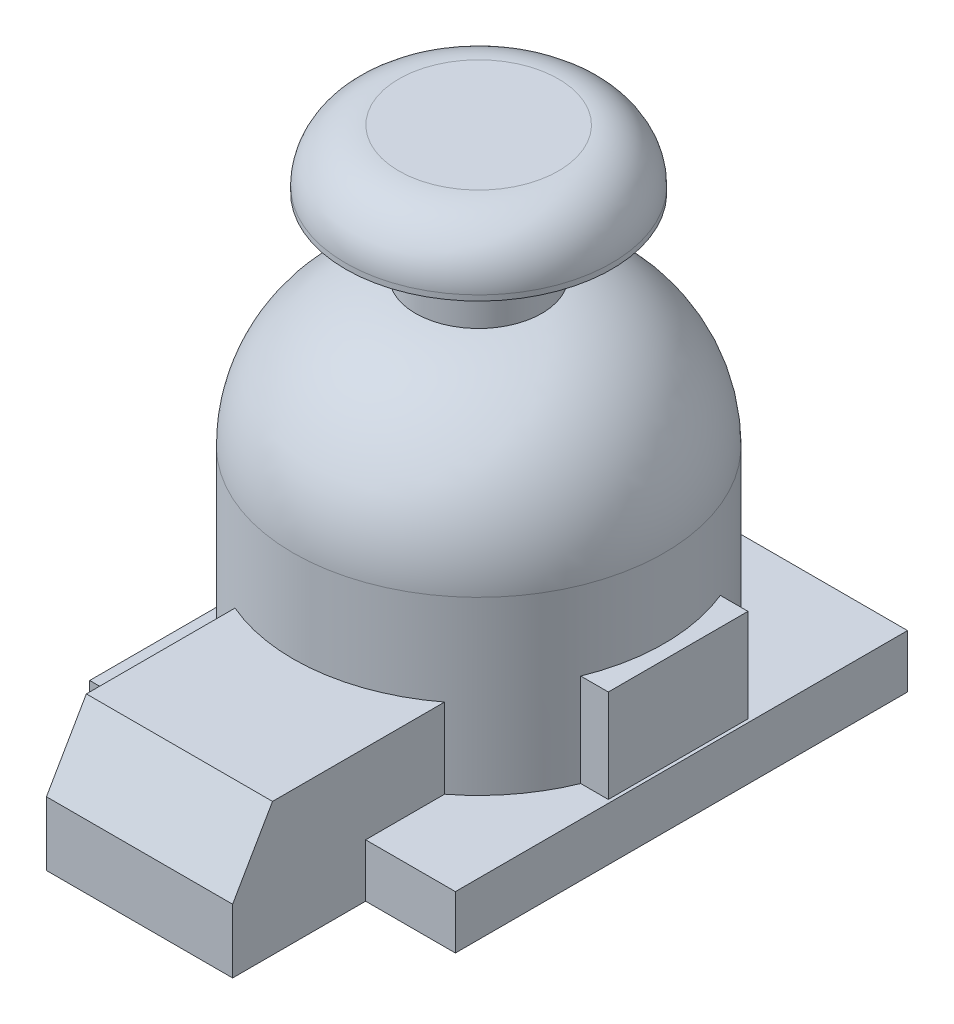
ISO-10303-21;
HEADER;
FILE_DESCRIPTION(('STEP AP214'),'2;1');
FILE_NAME('part.step','',(''),(''),'','','');
FILE_SCHEMA(('AUTOMOTIVE_DESIGN { 1 0 10303 214 1 1 1 1 }'));
ENDSEC;
DATA;
#1=APPLICATION_CONTEXT('core data for automotive mechanical design processes');
#2=APPLICATION_PROTOCOL_DEFINITION('international standard','automotive_design',2000,#1);
#3=PRODUCT_CONTEXT('',#1,'mechanical');
#4=PRODUCT('Part','Part','',(#3));
#5=PRODUCT_RELATED_PRODUCT_CATEGORY('part','',(#4));
#6=PRODUCT_DEFINITION_FORMATION('','',#4);
#7=PRODUCT_DEFINITION_CONTEXT('part definition',#1,'design');
#8=PRODUCT_DEFINITION('design','',#6,#7);
#9=PRODUCT_DEFINITION_SHAPE('','',#8);
#10=(LENGTH_UNIT() NAMED_UNIT(*) SI_UNIT(.MILLI.,.METRE.));
#11=(NAMED_UNIT(*) PLANE_ANGLE_UNIT() SI_UNIT($,.RADIAN.));
#12=(NAMED_UNIT(*) SI_UNIT($,.STERADIAN.) SOLID_ANGLE_UNIT());
#13=UNCERTAINTY_MEASURE_WITH_UNIT(LENGTH_MEASURE(1.E-05),#10,'distance_accuracy_value','');
#14=(GEOMETRIC_REPRESENTATION_CONTEXT(3) GLOBAL_UNCERTAINTY_ASSIGNED_CONTEXT((#13)) GLOBAL_UNIT_ASSIGNED_CONTEXT((#10,
#11,#12)) REPRESENTATION_CONTEXT('',''));
#15=CARTESIAN_POINT('',(0.,0.,0.));
#16=DIRECTION('',(0.,0.,1.));
#17=DIRECTION('',(1.,0.,0.));
#18=AXIS2_PLACEMENT_3D('',#15,#16,#17);
#19=CARTESIAN_POINT('',(13.75,4.,17.));
#20=DIRECTION('',(0.,0.,-1.));
#21=DIRECTION('',(-1.,0.,0.));
#22=AXIS2_PLACEMENT_3D('',#19,#20,#21);
#23=PLANE('',#22);
#24=DIRECTION('',(0.,-1.,0.));
#25=VECTOR('',#24,1.);
#26=CARTESIAN_POINT('',(-7.,10.,17.));
#27=LINE('',#26,#25);
#28=CARTESIAN_POINT('',(-7.,4.,17.));
#29=VERTEX_POINT('',#28);
#30=CARTESIAN_POINT('',(-7.,0.,17.));
#31=VERTEX_POINT('',#30);
#32=EDGE_CURVE('E205',#29,#31,#27,.T.);
#33=ORIENTED_EDGE('',*,*,#32,.F.);
#34=DIRECTION('',(1.,0.,0.));
#35=VECTOR('',#34,1.);
#36=CARTESIAN_POINT('',(13.75,4.,17.));
#37=LINE('',#36,#35);
#38=CARTESIAN_POINT('',(-13.75,4.,17.));
#39=VERTEX_POINT('',#38);
#40=EDGE_CURVE('E325',#39,#29,#37,.T.);
#41=ORIENTED_EDGE('',*,*,#40,.F.);
#42=DIRECTION('',(0.,-1.,0.));
#43=VECTOR('',#42,1.);
#44=CARTESIAN_POINT('',(-13.75,4.,17.));
#45=LINE('',#44,#43);
#46=CARTESIAN_POINT('',(-13.75,0.,17.));
#47=VERTEX_POINT('',#46);
#48=EDGE_CURVE('E348',#39,#47,#45,.T.);
#49=ORIENTED_EDGE('',*,*,#48,.T.);
#50=DIRECTION('',(1.,0.,0.));
#51=VECTOR('',#50,1.);
#52=CARTESIAN_POINT('',(13.75,0.,17.));
#53=LINE('',#52,#51);
#54=EDGE_CURVE('E336',#47,#31,#53,.T.);
#55=ORIENTED_EDGE('',*,*,#54,.T.);
#56=EDGE_LOOP('',(#33,#41,#49,#55));
#57=FACE_BOUND('',#56,.T.);
#58=ADVANCED_FACE('F37',(#57),#23,.F.);
#59=DIRECTION('',(0.,1.,0.));
#60=VECTOR('',#59,1.);
#61=CARTESIAN_POINT('',(7.,0.,17.));
#62=LINE('',#61,#60);
#63=CARTESIAN_POINT('',(7.,0.,17.));
#64=VERTEX_POINT('',#63);
#65=CARTESIAN_POINT('',(7.,4.,17.));
#66=VERTEX_POINT('',#65);
#67=EDGE_CURVE('E199',#64,#66,#62,.T.);
#68=ORIENTED_EDGE('',*,*,#67,.F.);
#69=CARTESIAN_POINT('',(13.75,0.,17.));
#70=VERTEX_POINT('',#69);
#71=EDGE_CURVE('E335',#64,#70,#53,.T.);
#72=ORIENTED_EDGE('',*,*,#71,.T.);
#73=DIRECTION('',(0.,-1.,0.));
#74=VECTOR('',#73,1.);
#75=CARTESIAN_POINT('',(13.75,4.,17.));
#76=LINE('',#75,#74);
#77=CARTESIAN_POINT('',(13.75,4.,17.));
#78=VERTEX_POINT('',#77);
#79=EDGE_CURVE('E345',#78,#70,#76,.T.);
#80=ORIENTED_EDGE('',*,*,#79,.F.);
#81=EDGE_CURVE('E322',#66,#78,#37,.T.);
#82=ORIENTED_EDGE('',*,*,#81,.F.);
#83=EDGE_LOOP('',(#68,#72,#80,#82));
#84=FACE_BOUND('',#83,.T.);
#85=ADVANCED_FACE('F407',(#84),#23,.F.);
#86=CARTESIAN_POINT('',(-1.5,-35.4565583902094,0.));
#87=DIRECTION('',(0.,1.,0.));
#88=DIRECTION('',(0.,0.,1.));
#89=AXIS2_PLACEMENT_3D('',#86,#87,#88);
#90=CYLINDRICAL_SURFACE('',#89,13.95);
#91=CARTESIAN_POINT('',(-1.5,4.,0.));
#92=DIRECTION('',(0.,1.,0.));
#93=DIRECTION('',(0.,0.,1.));
#94=AXIS2_PLACEMENT_3D('',#91,#92,#93);
#95=CIRCLE('',#94,13.95);
#96=CARTESIAN_POINT('',(-6.99999999999999,4.,12.8200039001554));
#97=VERTEX_POINT('',#96);
#98=CARTESIAN_POINT('',(-13.75,4.,6.67382948538544));
#99=VERTEX_POINT('',#98);
#100=EDGE_CURVE('E242',#97,#99,#95,.F.);
#101=ORIENTED_EDGE('',*,*,#100,.F.);
#102=DIRECTION('',(0.,1.,0.));
#103=VECTOR('',#102,1.);
#104=CARTESIAN_POINT('',(-6.99999999999999,-35.4565583902094,12.8200039001554));
#105=LINE('',#104,#103);
#106=CARTESIAN_POINT('',(-6.99999999999999,10.,12.8200039001554));
#107=VERTEX_POINT('',#106);
#108=EDGE_CURVE('E233',#97,#107,#105,.T.);
#109=ORIENTED_EDGE('',*,*,#108,.T.);
#110=CARTESIAN_POINT('',(-1.5,10.,0.));
#111=DIRECTION('',(0.,-1.,0.));
#112=DIRECTION('',(0.,0.,-1.));
#113=AXIS2_PLACEMENT_3D('',#110,#111,#112);
#114=CIRCLE('',#113,13.95);
#115=CARTESIAN_POINT('',(7.,10.,11.0613064327863));
#116=VERTEX_POINT('',#115);
#117=EDGE_CURVE('E367',#107,#116,#114,.F.);
#118=ORIENTED_EDGE('',*,*,#117,.T.);
#119=DIRECTION('',(0.,1.,0.));
#120=VECTOR('',#119,1.);
#121=CARTESIAN_POINT('',(7.,-35.4565583902094,11.0613064327863));
#122=LINE('',#121,#120);
#123=CARTESIAN_POINT('',(7.00000000000001,4.,11.0613064327863));
#124=VERTEX_POINT('',#123);
#125=EDGE_CURVE('E228',#116,#124,#122,.F.);
#126=ORIENTED_EDGE('',*,*,#125,.T.);
#127=CARTESIAN_POINT('',(11.4243955371228,4.,5.25));
#128=VERTEX_POINT('',#127);
#129=EDGE_CURVE('E540',#128,#124,#95,.F.);
#130=ORIENTED_EDGE('',*,*,#129,.F.);
#131=DIRECTION('',(0.,1.,0.));
#132=VECTOR('',#131,1.);
#133=CARTESIAN_POINT('',(11.4243955371228,-35.4565583902094,5.24999999999999));
#134=LINE('',#133,#132);
#135=CARTESIAN_POINT('',(11.4243955371228,11.,5.24999999999999));
#136=VERTEX_POINT('',#135);
#137=EDGE_CURVE('E351',#136,#128,#134,.F.);
#138=ORIENTED_EDGE('',*,*,#137,.F.);
#139=CARTESIAN_POINT('',(-1.5,11.,0.));
#140=DIRECTION('',(0.,-1.,0.));
#141=DIRECTION('',(0.,0.,-1.));
#142=AXIS2_PLACEMENT_3D('',#139,#140,#141);
#143=CIRCLE('',#142,13.95);
#144=CARTESIAN_POINT('',(11.4243955371228,11.,-5.25));
#145=VERTEX_POINT('',#144);
#146=EDGE_CURVE('E248',#145,#136,#143,.T.);
#147=ORIENTED_EDGE('',*,*,#146,.F.);
#148=DIRECTION('',(0.,1.,0.));
#149=VECTOR('',#148,1.);
#150=CARTESIAN_POINT('',(11.4243955371228,-35.4565583902094,-5.25000000000001));
#151=LINE('',#150,#149);
#152=CARTESIAN_POINT('',(11.4243955371228,4.,-5.25));
#153=VERTEX_POINT('',#152);
#154=EDGE_CURVE('E252',#153,#145,#151,.T.);
#155=ORIENTED_EDGE('',*,*,#154,.F.);
#156=CARTESIAN_POINT('',(4.,4.,-12.8200039001554));
#157=VERTEX_POINT('',#156);
#158=EDGE_CURVE('E539',#157,#153,#95,.F.);
#159=ORIENTED_EDGE('',*,*,#158,.F.);
#160=DIRECTION('',(0.,1.,0.));
#161=VECTOR('',#160,1.);
#162=CARTESIAN_POINT('',(4.,-35.4565583902094,-12.8200039001554));
#163=LINE('',#162,#161);
#164=CARTESIAN_POINT('',(4.,16.9,-12.8200039001554));
#165=VERTEX_POINT('',#164);
#166=EDGE_CURVE('E268',#165,#157,#163,.F.);
#167=ORIENTED_EDGE('',*,*,#166,.F.);
#168=CARTESIAN_POINT('',(-1.5,16.9,0.));
#169=DIRECTION('',(0.,1.,0.));
#170=DIRECTION('',(0.,0.,1.));
#171=AXIS2_PLACEMENT_3D('',#168,#169,#170);
#172=CIRCLE('',#171,13.95);
#173=CARTESIAN_POINT('',(-7.,16.9,-12.8200039001554));
#174=VERTEX_POINT('',#173);
#175=EDGE_CURVE('E357',#165,#174,#172,.F.);
#176=ORIENTED_EDGE('',*,*,#175,.T.);
#177=DIRECTION('',(0.,1.,0.));
#178=VECTOR('',#177,1.);
#179=CARTESIAN_POINT('',(-7.,-35.4565583902094,-12.8200039001554));
#180=LINE('',#179,#178);
#181=CARTESIAN_POINT('',(-7.,4.,-12.8200039001554));
#182=VERTEX_POINT('',#181);
#183=EDGE_CURVE('E261',#182,#174,#180,.T.);
#184=ORIENTED_EDGE('',*,*,#183,.F.);
#185=CARTESIAN_POINT('',(-13.75,4.,-6.67382948538543));
#186=VERTEX_POINT('',#185);
#187=EDGE_CURVE('E249',#186,#182,#95,.F.);
#188=ORIENTED_EDGE('',*,*,#187,.F.);
#189=EDGE_CURVE('E245',#99,#186,#95,.F.);
#190=ORIENTED_EDGE('',*,*,#189,.F.);
#191=EDGE_LOOP('',(#101,#109,#118,#126,#130,#138,#147,#155,#159,#167,#176,#184,#188,#190));
#192=FACE_BOUND('',#191,.T.);
#193=ADVANCED_FACE('F425',(#192),#90,.T.);
#194=CARTESIAN_POINT('',(0.,4.,0.));
#195=DIRECTION('',(0.,1.,0.));
#196=DIRECTION('',(0.,0.,1.));
#197=AXIS2_PLACEMENT_3D('',#194,#195,#196);
#198=PLANE('',#197);
#199=ORIENTED_EDGE('',*,*,#40,.T.);
#200=DIRECTION('',(0.,0.,1.));
#201=VECTOR('',#200,1.);
#202=CARTESIAN_POINT('',(-6.99999999999999,4.,17.));
#203=LINE('',#202,#201);
#204=EDGE_CURVE('E209',#97,#29,#203,.T.);
#205=ORIENTED_EDGE('',*,*,#204,.F.);
#206=ORIENTED_EDGE('',*,*,#100,.T.);
#207=DIRECTION('',(0.,0.,1.));
#208=VECTOR('',#207,1.);
#209=CARTESIAN_POINT('',(-13.75,4.,17.));
#210=LINE('',#209,#208);
#211=EDGE_CURVE('E324',#99,#39,#210,.T.);
#212=ORIENTED_EDGE('',*,*,#211,.T.);
#213=EDGE_LOOP('',(#199,#205,#206,#212));
#214=FACE_BOUND('',#213,.T.);
#215=ADVANCED_FACE('F478',(#214),#198,.T.);
#216=DIRECTION('',(-1.,0.,0.));
#217=VECTOR('',#216,1.);
#218=CARTESIAN_POINT('',(13.75,4.,-17.));
#219=LINE('',#218,#217);
#220=CARTESIAN_POINT('',(13.75,4.,-17.));
#221=VERTEX_POINT('',#220);
#222=CARTESIAN_POINT('',(-11.75,4.,-17.));
#223=VERTEX_POINT('',#222);
#224=EDGE_CURVE('E330',#221,#223,#219,.T.);
#225=ORIENTED_EDGE('',*,*,#224,.T.);
#226=DIRECTION('',(0.707106781186548,0.,-0.707106781186548));
#227=VECTOR('',#226,1.);
#228=CARTESIAN_POINT('',(-14.375,4.,-14.375));
#229=LINE('',#228,#227);
#230=CARTESIAN_POINT('',(-13.75,4.,-15.));
#231=VERTEX_POINT('',#230);
#232=EDGE_CURVE('E377',#223,#231,#229,.F.);
#233=ORIENTED_EDGE('',*,*,#232,.T.);
#234=EDGE_CURVE('E320',#231,#186,#210,.T.);
#235=ORIENTED_EDGE('',*,*,#234,.T.);
#236=ORIENTED_EDGE('',*,*,#187,.T.);
#237=DIRECTION('',(0.,0.,1.));
#238=VECTOR('',#237,1.);
#239=CARTESIAN_POINT('',(-7.,4.00000000000001,-13.5));
#240=LINE('',#239,#238);
#241=CARTESIAN_POINT('',(-7.,4.00000000000001,-13.5));
#242=VERTEX_POINT('',#241);
#243=EDGE_CURVE('E307',#242,#182,#240,.T.);
#244=ORIENTED_EDGE('',*,*,#243,.F.);
#245=DIRECTION('',(-1.,0.,0.));
#246=VECTOR('',#245,1.);
#247=CARTESIAN_POINT('',(4.,4.00000000000001,-13.5));
#248=LINE('',#247,#246);
#249=CARTESIAN_POINT('',(-5.01461235415797,4.,-13.5));
#250=VERTEX_POINT('',#249);
#251=EDGE_CURVE('E303',#250,#242,#248,.T.);
#252=ORIENTED_EDGE('',*,*,#251,.F.);
#253=CARTESIAN_POINT('',(2.01461235415797,4.,-13.5));
#254=VERTEX_POINT('',#253);
#255=EDGE_CURVE('E535',#250,#254,#95,.F.);
#256=ORIENTED_EDGE('',*,*,#255,.T.);
#257=CARTESIAN_POINT('',(4.,4.00000000000001,-13.5));
#258=VERTEX_POINT('',#257);
#259=EDGE_CURVE('E304',#258,#254,#248,.T.);
#260=ORIENTED_EDGE('',*,*,#259,.F.);
#261=DIRECTION('',(0.,0.,1.));
#262=VECTOR('',#261,1.);
#263=CARTESIAN_POINT('',(4.,4.00000000000001,-13.5));
#264=LINE('',#263,#262);
#265=EDGE_CURVE('E310',#258,#157,#264,.T.);
#266=ORIENTED_EDGE('',*,*,#265,.T.);
#267=ORIENTED_EDGE('',*,*,#158,.T.);
#268=DIRECTION('',(-1.,0.,0.));
#269=VECTOR('',#268,1.);
#270=CARTESIAN_POINT('',(13.5,4.,-5.25));
#271=LINE('',#270,#269);
#272=CARTESIAN_POINT('',(13.5,4.,-5.25));
#273=VERTEX_POINT('',#272);
#274=EDGE_CURVE('E282',#273,#153,#271,.T.);
#275=ORIENTED_EDGE('',*,*,#274,.F.);
#276=DIRECTION('',(0.,0.,-1.));
#277=VECTOR('',#276,1.);
#278=CARTESIAN_POINT('',(13.5,4.,5.25));
#279=LINE('',#278,#277);
#280=CARTESIAN_POINT('',(13.5,4.,5.25));
#281=VERTEX_POINT('',#280);
#282=EDGE_CURVE('E279',#281,#273,#279,.T.);
#283=ORIENTED_EDGE('',*,*,#282,.F.);
#284=DIRECTION('',(-1.,0.,0.));
#285=VECTOR('',#284,1.);
#286=CARTESIAN_POINT('',(13.5,4.,5.25));
#287=LINE('',#286,#285);
#288=EDGE_CURVE('E285',#281,#128,#287,.T.);
#289=ORIENTED_EDGE('',*,*,#288,.T.);
#290=ORIENTED_EDGE('',*,*,#129,.T.);
#291=DIRECTION('',(0.,0.,-1.));
#292=VECTOR('',#291,1.);
#293=CARTESIAN_POINT('',(7.00000000000001,4.,13.));
#294=LINE('',#293,#292);
#295=EDGE_CURVE('E226',#66,#124,#294,.T.);
#296=ORIENTED_EDGE('',*,*,#295,.F.);
#297=ORIENTED_EDGE('',*,*,#81,.T.);
#298=DIRECTION('',(0.,0.,-1.));
#299=VECTOR('',#298,1.);
#300=CARTESIAN_POINT('',(13.75,4.,17.));
#301=LINE('',#300,#299);
#302=EDGE_CURVE('E328',#78,#221,#301,.T.);
#303=ORIENTED_EDGE('',*,*,#302,.T.);
#304=EDGE_LOOP('',(#225,#233,#235,#236,#244,#252,#256,#260,#266,#267,#275,#283,#289,#290,#296,
#297,#303));
#305=FACE_BOUND('',#304,.T.);
#306=ADVANCED_FACE('F383',(#305),#198,.T.);
#307=DIRECTION('',(0.,1.,0.));
#308=VECTOR('',#307,1.);
#309=CARTESIAN_POINT('',(-5.01461235415797,-35.4565583902094,-13.5));
#310=LINE('',#309,#308);
#311=CARTESIAN_POINT('',(-5.01461235415797,16.9,-13.5));
#312=VERTEX_POINT('',#311);
#313=EDGE_CURVE('E255',#312,#250,#310,.F.);
#314=ORIENTED_EDGE('',*,*,#313,.F.);
#315=CARTESIAN_POINT('',(-1.5,16.9,0.));
#316=DIRECTION('',(0.,1.,0.));
#317=DIRECTION('',(0.,0.,1.));
#318=AXIS2_PLACEMENT_3D('',#315,#316,#317);
#319=CIRCLE('',#318,13.95);
#320=CARTESIAN_POINT('',(2.01461235415797,16.9,-13.5));
#321=VERTEX_POINT('',#320);
#322=EDGE_CURVE('E359',#312,#321,#319,.F.);
#323=ORIENTED_EDGE('',*,*,#322,.T.);
#324=DIRECTION('',(0.,1.,0.));
#325=VECTOR('',#324,1.);
#326=CARTESIAN_POINT('',(2.01461235415797,-35.4565583902094,-13.5));
#327=LINE('',#326,#325);
#328=EDGE_CURVE('E265',#254,#321,#327,.T.);
#329=ORIENTED_EDGE('',*,*,#328,.F.);
#330=ORIENTED_EDGE('',*,*,#255,.F.);
#331=EDGE_LOOP('',(#314,#323,#329,#330));
#332=FACE_BOUND('',#331,.T.);
#333=ADVANCED_FACE('F474',(#332),#90,.T.);
#334=CARTESIAN_POINT('',(0.,4.,0.));
#335=DIRECTION('',(0.,1.,0.));
#336=DIRECTION('',(0.,0.,1.));
#337=AXIS2_PLACEMENT_3D('',#334,#335,#336);
#338=PLANE('',#337);
#339=ORIENTED_EDGE('',*,*,#189,.T.);
#340=EDGE_CURVE('E323',#186,#99,#210,.T.);
#341=ORIENTED_EDGE('',*,*,#340,.T.);
#342=EDGE_LOOP('',(#339,#341));
#343=FACE_BOUND('',#342,.T.);
#344=ADVANCED_FACE('F432',(#343),#338,.F.);
#345=CARTESIAN_POINT('',(-13.75,4.,17.));
#346=DIRECTION('',(1.,0.,0.));
#347=DIRECTION('',(0.,0.,-1.));
#348=AXIS2_PLACEMENT_3D('',#345,#346,#347);
#349=PLANE('',#348);
#350=ORIENTED_EDGE('',*,*,#234,.F.);
#351=DIRECTION('',(0.,-1.,0.));
#352=VECTOR('',#351,1.);
#353=CARTESIAN_POINT('',(-13.75,4.,-15.));
#354=LINE('',#353,#352);
#355=CARTESIAN_POINT('',(-13.75,0.,-15.));
#356=VERTEX_POINT('',#355);
#357=EDGE_CURVE('E370',#231,#356,#354,.T.);
#358=ORIENTED_EDGE('',*,*,#357,.T.);
#359=DIRECTION('',(0.,0.,1.));
#360=VECTOR('',#359,1.);
#361=CARTESIAN_POINT('',(-13.75,0.,17.));
#362=LINE('',#361,#360);
#363=EDGE_CURVE('E319',#356,#47,#362,.T.);
#364=ORIENTED_EDGE('',*,*,#363,.T.);
#365=ORIENTED_EDGE('',*,*,#48,.F.);
#366=ORIENTED_EDGE('',*,*,#211,.F.);
#367=ORIENTED_EDGE('',*,*,#340,.F.);
#368=EDGE_LOOP('',(#350,#358,#364,#365,#366,#367));
#369=FACE_BOUND('',#368,.T.);
#370=ADVANCED_FACE('F391',(#369),#349,.F.);
#371=CARTESIAN_POINT('',(0.,16.9,0.));
#372=DIRECTION('',(0.,1.,0.));
#373=DIRECTION('',(0.,0.,1.));
#374=AXIS2_PLACEMENT_3D('',#371,#372,#373);
#375=PLANE('',#374);
#376=CARTESIAN_POINT('',(-1.5,16.9,0.));
#377=DIRECTION('',(0.,1.,0.));
#378=DIRECTION('',(0.,0.,1.));
#379=AXIS2_PLACEMENT_3D('',#376,#377,#378);
#380=CIRCLE('',#379,13.95);
#381=EDGE_CURVE('E262',#165,#321,#380,.T.);
#382=ORIENTED_EDGE('',*,*,#381,.F.);
#383=DIRECTION('',(0.,0.,1.));
#384=VECTOR('',#383,1.);
#385=CARTESIAN_POINT('',(4.,16.9,-13.5));
#386=LINE('',#385,#384);
#387=CARTESIAN_POINT('',(4.,16.9,-13.5));
#388=VERTEX_POINT('',#387);
#389=EDGE_CURVE('E313',#388,#165,#386,.T.);
#390=ORIENTED_EDGE('',*,*,#389,.F.);
#391=DIRECTION('',(1.,0.,0.));
#392=VECTOR('',#391,1.);
#393=CARTESIAN_POINT('',(4.,16.9,-13.5));
#394=LINE('',#393,#392);
#395=EDGE_CURVE('E297',#321,#388,#394,.T.);
#396=ORIENTED_EDGE('',*,*,#395,.F.);
#397=EDGE_LOOP('',(#382,#390,#396));
#398=FACE_BOUND('',#397,.T.);
#399=ADVANCED_FACE('F431',(#398),#375,.T.);
#400=CARTESIAN_POINT('',(0.,0.,-13.5));
#401=DIRECTION('',(0.,0.,1.));
#402=DIRECTION('',(1.,0.,0.));
#403=AXIS2_PLACEMENT_3D('',#400,#401,#402);
#404=PLANE('',#403);
#405=ORIENTED_EDGE('',*,*,#259,.T.);
#406=ORIENTED_EDGE('',*,*,#328,.T.);
#407=ORIENTED_EDGE('',*,*,#395,.T.);
#408=DIRECTION('',(0.,-1.,0.));
#409=VECTOR('',#408,1.);
#410=CARTESIAN_POINT('',(4.,4.00000000000001,-13.5));
#411=LINE('',#410,#409);
#412=EDGE_CURVE('E301',#388,#258,#411,.T.);
#413=ORIENTED_EDGE('',*,*,#412,.T.);
#414=EDGE_LOOP('',(#405,#406,#407,#413));
#415=FACE_BOUND('',#414,.T.);
#416=ADVANCED_FACE('F500',(#415),#404,.F.);
#417=CARTESIAN_POINT('',(13.75,4.,17.));
#418=DIRECTION('',(-1.,0.,0.));
#419=DIRECTION('',(0.,0.,1.));
#420=AXIS2_PLACEMENT_3D('',#417,#418,#419);
#421=PLANE('',#420);
#422=DIRECTION('',(0.,0.,-1.));
#423=VECTOR('',#422,1.);
#424=CARTESIAN_POINT('',(13.75,0.,17.));
#425=LINE('',#424,#423);
#426=CARTESIAN_POINT('',(13.75,0.,-17.));
#427=VERTEX_POINT('',#426);
#428=EDGE_CURVE('E338',#70,#427,#425,.T.);
#429=ORIENTED_EDGE('',*,*,#428,.T.);
#430=DIRECTION('',(0.,-1.,0.));
#431=VECTOR('',#430,1.);
#432=CARTESIAN_POINT('',(13.75,4.,-17.));
#433=LINE('',#432,#431);
#434=EDGE_CURVE('E333',#221,#427,#433,.T.);
#435=ORIENTED_EDGE('',*,*,#434,.F.);
#436=ORIENTED_EDGE('',*,*,#302,.F.);
#437=ORIENTED_EDGE('',*,*,#79,.T.);
#438=EDGE_LOOP('',(#429,#435,#436,#437));
#439=FACE_BOUND('',#438,.T.);
#440=ADVANCED_FACE('F403',(#439),#421,.F.);
#441=CARTESIAN_POINT('',(13.75,4.,-17.));
#442=DIRECTION('',(0.,0.,1.));
#443=DIRECTION('',(1.,0.,0.));
#444=AXIS2_PLACEMENT_3D('',#441,#442,#443);
#445=PLANE('',#444);
#446=DIRECTION('',(-1.,0.,0.));
#447=VECTOR('',#446,1.);
#448=CARTESIAN_POINT('',(13.75,0.,-17.));
#449=LINE('',#448,#447);
#450=CARTESIAN_POINT('',(-11.75,0.,-17.));
#451=VERTEX_POINT('',#450);
#452=EDGE_CURVE('E340',#427,#451,#449,.T.);
#453=ORIENTED_EDGE('',*,*,#452,.T.);
#454=DIRECTION('',(0.,1.,0.));
#455=VECTOR('',#454,1.);
#456=CARTESIAN_POINT('',(-11.75,4.,-17.));
#457=LINE('',#456,#455);
#458=EDGE_CURVE('E375',#451,#223,#457,.T.);
#459=ORIENTED_EDGE('',*,*,#458,.T.);
#460=ORIENTED_EDGE('',*,*,#224,.F.);
#461=ORIENTED_EDGE('',*,*,#434,.T.);
#462=EDGE_LOOP('',(#453,#459,#460,#461));
#463=FACE_BOUND('',#462,.T.);
#464=ADVANCED_FACE('F399',(#463),#445,.F.);
#465=CARTESIAN_POINT('',(0.,0.,0.));
#466=DIRECTION('',(0.,1.,0.));
#467=DIRECTION('',(0.,0.,1.));
#468=AXIS2_PLACEMENT_3D('',#465,#466,#467);
#469=PLANE('',#468);
#470=ORIENTED_EDGE('',*,*,#363,.F.);
#471=DIRECTION('',(-0.707106781186548,0.,0.707106781186548));
#472=VECTOR('',#471,1.);
#473=CARTESIAN_POINT('',(-13.75,0.,-15.));
#474=LINE('',#473,#472);
#475=EDGE_CURVE('E373',#356,#451,#474,.F.);
#476=ORIENTED_EDGE('',*,*,#475,.T.);
#477=ORIENTED_EDGE('',*,*,#452,.F.);
#478=ORIENTED_EDGE('',*,*,#428,.F.);
#479=ORIENTED_EDGE('',*,*,#71,.F.);
#480=DIRECTION('',(0.,0.,-1.));
#481=VECTOR('',#480,1.);
#482=CARTESIAN_POINT('',(7.,0.,27.));
#483=LINE('',#482,#481);
#484=CARTESIAN_POINT('',(7.,0.,27.));
#485=VERTEX_POINT('',#484);
#486=EDGE_CURVE('E210',#485,#64,#483,.T.);
#487=ORIENTED_EDGE('',*,*,#486,.F.);
#488=DIRECTION('',(1.,0.,0.));
#489=VECTOR('',#488,1.);
#490=CARTESIAN_POINT('',(-7.,0.,27.));
#491=LINE('',#490,#489);
#492=CARTESIAN_POINT('',(-7.,0.,27.));
#493=VERTEX_POINT('',#492);
#494=EDGE_CURVE('E195',#493,#485,#491,.T.);
#495=ORIENTED_EDGE('',*,*,#494,.F.);
#496=DIRECTION('',(0.,0.,-1.));
#497=VECTOR('',#496,1.);
#498=CARTESIAN_POINT('',(-7.,0.,27.));
#499=LINE('',#498,#497);
#500=EDGE_CURVE('E202',#493,#31,#499,.T.);
#501=ORIENTED_EDGE('',*,*,#500,.T.);
#502=ORIENTED_EDGE('',*,*,#54,.F.);
#503=EDGE_LOOP('',(#470,#476,#477,#478,#479,#487,#495,#501,#502));
#504=FACE_BOUND('',#503,.T.);
#505=ADVANCED_FACE('F213',(#504),#469,.F.);
#506=EDGE_CURVE('E258',#312,#174,#380,.T.);
#507=ORIENTED_EDGE('',*,*,#506,.F.);
#508=CARTESIAN_POINT('',(-7.,16.9,-13.5));
#509=VERTEX_POINT('',#508);
#510=EDGE_CURVE('E298',#509,#312,#394,.T.);
#511=ORIENTED_EDGE('',*,*,#510,.F.);
#512=DIRECTION('',(0.,0.,1.));
#513=VECTOR('',#512,1.);
#514=CARTESIAN_POINT('',(-7.,16.9,-13.5));
#515=LINE('',#514,#513);
#516=EDGE_CURVE('E316',#509,#174,#515,.T.);
#517=ORIENTED_EDGE('',*,*,#516,.T.);
#518=EDGE_LOOP('',(#507,#511,#517));
#519=FACE_BOUND('',#518,.T.);
#520=ADVANCED_FACE('F507',(#519),#375,.T.);
#521=CARTESIAN_POINT('',(-7.,4.00000000000001,-13.5));
#522=DIRECTION('',(1.,0.,0.));
#523=DIRECTION('',(0.,0.,-1.));
#524=AXIS2_PLACEMENT_3D('',#521,#522,#523);
#525=PLANE('',#524);
#526=ORIENTED_EDGE('',*,*,#243,.T.);
#527=ORIENTED_EDGE('',*,*,#183,.T.);
#528=ORIENTED_EDGE('',*,*,#516,.F.);
#529=DIRECTION('',(0.,1.,0.));
#530=VECTOR('',#529,1.);
#531=CARTESIAN_POINT('',(-7.,4.00000000000001,-13.5));
#532=LINE('',#531,#530);
#533=EDGE_CURVE('E294',#242,#509,#532,.T.);
#534=ORIENTED_EDGE('',*,*,#533,.F.);
#535=EDGE_LOOP('',(#526,#527,#528,#534));
#536=FACE_BOUND('',#535,.T.);
#537=ADVANCED_FACE('F503',(#536),#525,.F.);
#538=CARTESIAN_POINT('',(4.,4.00000000000001,-13.5));
#539=DIRECTION('',(-1.,0.,0.));
#540=DIRECTION('',(0.,-1.,0.));
#541=AXIS2_PLACEMENT_3D('',#538,#539,#540);
#542=PLANE('',#541);
#543=ORIENTED_EDGE('',*,*,#389,.T.);
#544=ORIENTED_EDGE('',*,*,#166,.T.);
#545=ORIENTED_EDGE('',*,*,#265,.F.);
#546=ORIENTED_EDGE('',*,*,#412,.F.);
#547=EDGE_LOOP('',(#543,#544,#545,#546));
#548=FACE_BOUND('',#547,.T.);
#549=ADVANCED_FACE('F498',(#548),#542,.F.);
#550=ORIENTED_EDGE('',*,*,#510,.T.);
#551=ORIENTED_EDGE('',*,*,#313,.T.);
#552=ORIENTED_EDGE('',*,*,#251,.T.);
#553=ORIENTED_EDGE('',*,*,#533,.T.);
#554=EDGE_LOOP('',(#550,#551,#552,#553));
#555=FACE_BOUND('',#554,.T.);
#556=ADVANCED_FACE('F494',(#555),#404,.F.);
#557=CARTESIAN_POINT('',(13.5,11.,-5.25));
#558=DIRECTION('',(0.,0.,1.));
#559=DIRECTION('',(0.,-1.,0.));
#560=AXIS2_PLACEMENT_3D('',#557,#558,#559);
#561=PLANE('',#560);
#562=ORIENTED_EDGE('',*,*,#274,.T.);
#563=ORIENTED_EDGE('',*,*,#154,.T.);
#564=DIRECTION('',(-1.,0.,0.));
#565=VECTOR('',#564,1.);
#566=CARTESIAN_POINT('',(13.5,11.,-5.25));
#567=LINE('',#566,#565);
#568=CARTESIAN_POINT('',(13.5,11.,-5.25));
#569=VERTEX_POINT('',#568);
#570=EDGE_CURVE('E291',#569,#145,#567,.T.);
#571=ORIENTED_EDGE('',*,*,#570,.F.);
#572=DIRECTION('',(0.,1.,0.));
#573=VECTOR('',#572,1.);
#574=CARTESIAN_POINT('',(13.5,11.,-5.25));
#575=LINE('',#574,#573);
#576=EDGE_CURVE('E271',#273,#569,#575,.T.);
#577=ORIENTED_EDGE('',*,*,#576,.F.);
#578=EDGE_LOOP('',(#562,#563,#571,#577));
#579=FACE_BOUND('',#578,.T.);
#580=ADVANCED_FACE('F490',(#579),#561,.F.);
#581=CARTESIAN_POINT('',(13.5,11.,5.25));
#582=DIRECTION('',(0.,-1.,0.));
#583=DIRECTION('',(0.,0.,-1.));
#584=AXIS2_PLACEMENT_3D('',#581,#582,#583);
#585=PLANE('',#584);
#586=ORIENTED_EDGE('',*,*,#570,.T.);
#587=ORIENTED_EDGE('',*,*,#146,.T.);
#588=DIRECTION('',(-1.,0.,0.));
#589=VECTOR('',#588,1.);
#590=CARTESIAN_POINT('',(13.5,11.,5.25));
#591=LINE('',#590,#589);
#592=CARTESIAN_POINT('',(13.5,11.,5.25));
#593=VERTEX_POINT('',#592);
#594=EDGE_CURVE('E288',#593,#136,#591,.T.);
#595=ORIENTED_EDGE('',*,*,#594,.F.);
#596=DIRECTION('',(0.,0.,1.));
#597=VECTOR('',#596,1.);
#598=CARTESIAN_POINT('',(13.5,11.,5.25));
#599=LINE('',#598,#597);
#600=EDGE_CURVE('E274',#569,#593,#599,.T.);
#601=ORIENTED_EDGE('',*,*,#600,.F.);
#602=EDGE_LOOP('',(#586,#587,#595,#601));
#603=FACE_BOUND('',#602,.T.);
#604=ADVANCED_FACE('F486',(#603),#585,.F.);
#605=CARTESIAN_POINT('',(13.5,11.,5.25));
#606=DIRECTION('',(0.,0.,-1.));
#607=DIRECTION('',(0.,1.,0.));
#608=AXIS2_PLACEMENT_3D('',#605,#606,#607);
#609=PLANE('',#608);
#610=ORIENTED_EDGE('',*,*,#594,.T.);
#611=ORIENTED_EDGE('',*,*,#137,.T.);
#612=ORIENTED_EDGE('',*,*,#288,.F.);
#613=DIRECTION('',(0.,-1.,0.));
#614=VECTOR('',#613,1.);
#615=CARTESIAN_POINT('',(13.5,11.,5.25));
#616=LINE('',#615,#614);
#617=EDGE_CURVE('E276',#593,#281,#616,.T.);
#618=ORIENTED_EDGE('',*,*,#617,.F.);
#619=EDGE_LOOP('',(#610,#611,#612,#618));
#620=FACE_BOUND('',#619,.T.);
#621=ADVANCED_FACE('F482',(#620),#609,.F.);
#622=CARTESIAN_POINT('',(13.5,0.,0.));
#623=DIRECTION('',(1.,0.,0.));
#624=DIRECTION('',(0.,0.,-1.));
#625=AXIS2_PLACEMENT_3D('',#622,#623,#624);
#626=PLANE('',#625);
#627=ORIENTED_EDGE('',*,*,#576,.T.);
#628=ORIENTED_EDGE('',*,*,#600,.T.);
#629=ORIENTED_EDGE('',*,*,#617,.T.);
#630=ORIENTED_EDGE('',*,*,#282,.T.);
#631=EDGE_LOOP('',(#627,#628,#629,#630));
#632=FACE_BOUND('',#631,.T.);
#633=ADVANCED_FACE('F437',(#632),#626,.T.);
#634=CARTESIAN_POINT('',(-1.5,16.9,0.));
#635=DIRECTION('',(0.,1.,0.));
#636=DIRECTION('',(0.,0.,1.));
#637=AXIS2_PLACEMENT_3D('',#634,#635,#636);
#638=DEGENERATE_TOROIDAL_SURFACE('',#637,2.95,11.,.T.);
#639=ORIENTED_EDGE('',*,*,#322,.F.);
#640=ORIENTED_EDGE('',*,*,#506,.T.);
#641=ORIENTED_EDGE('',*,*,#175,.F.);
#642=ORIENTED_EDGE('',*,*,#381,.T.);
#643=EDGE_LOOP('',(#639,#640,#641,#642));
#644=FACE_BOUND('',#643,.T.);
#645=CARTESIAN_POINT('',(-1.5,27.9,0.));
#646=DIRECTION('',(0.,1.,0.));
#647=DIRECTION('',(0.,0.,1.));
#648=AXIS2_PLACEMENT_3D('',#645,#646,#647);
#649=CIRCLE('',#648,2.95);
#650=CARTESIAN_POINT('',(-1.5,27.9,2.95));
#651=VERTEX_POINT('',#650);
#652=EDGE_CURVE('E354',#651,#651,#649,.T.);
#653=ORIENTED_EDGE('',*,*,#652,.F.);
#654=EDGE_LOOP('',(#653));
#655=FACE_BOUND('',#654,.T.);
#656=ADVANCED_FACE('F433',(#644,#655),#638,.T.);
#657=CARTESIAN_POINT('',(-1.5,33.4,0.));
#658=DIRECTION('',(0.,-1.,0.));
#659=DIRECTION('',(0.,0.,-1.));
#660=AXIS2_PLACEMENT_3D('',#657,#658,#659);
#661=CYLINDRICAL_SURFACE('',#660,4.75);
#662=CARTESIAN_POINT('',(-1.5,33.4,0.));
#663=DIRECTION('',(0.,1.,0.));
#664=DIRECTION('',(0.,0.,1.));
#665=AXIS2_PLACEMENT_3D('',#662,#663,#664);
#666=CIRCLE('',#665,4.75);
#667=CARTESIAN_POINT('',(-1.5,33.4,4.75));
#668=VERTEX_POINT('',#667);
#669=EDGE_CURVE('E239',#668,#668,#666,.T.);
#670=ORIENTED_EDGE('',*,*,#669,.F.);
#671=EDGE_LOOP('',(#670));
#672=FACE_BOUND('',#671,.T.);
#673=CARTESIAN_POINT('',(-1.5,27.9,0.));
#674=DIRECTION('',(0.,1.,0.));
#675=DIRECTION('',(0.,0.,1.));
#676=AXIS2_PLACEMENT_3D('',#673,#674,#675);
#677=CIRCLE('',#676,4.75);
#678=CARTESIAN_POINT('',(-1.5,27.9,4.75));
#679=VERTEX_POINT('',#678);
#680=EDGE_CURVE('E238',#679,#679,#677,.T.);
#681=ORIENTED_EDGE('',*,*,#680,.T.);
#682=EDGE_LOOP('',(#681));
#683=FACE_BOUND('',#682,.T.);
#684=ADVANCED_FACE('F436',(#672,#683),#661,.T.);
#685=CARTESIAN_POINT('',(-1.5,27.9,0.));
#686=DIRECTION('',(0.,1.,0.));
#687=DIRECTION('',(0.,0.,1.));
#688=AXIS2_PLACEMENT_3D('',#685,#686,#687);
#689=PLANE('',#688);
#690=ORIENTED_EDGE('',*,*,#652,.T.);
#691=EDGE_LOOP('',(#690));
#692=FACE_BOUND('',#691,.T.);
#693=ORIENTED_EDGE('',*,*,#680,.F.);
#694=EDGE_LOOP('',(#693));
#695=FACE_BOUND('',#694,.T.);
#696=ADVANCED_FACE('F461',(#692,#695),#689,.F.);
#697=CARTESIAN_POINT('',(-1.5,37.8,0.));
#698=DIRECTION('',(0.,-1.,0.));
#699=DIRECTION('',(0.,0.,-1.));
#700=AXIS2_PLACEMENT_3D('',#697,#698,#699);
#701=CYLINDRICAL_SURFACE('',#700,10.);
#702=CARTESIAN_POINT('',(-1.5,33.8,0.));
#703=DIRECTION('',(0.,1.,0.));
#704=DIRECTION('',(0.,0.,1.));
#705=AXIS2_PLACEMENT_3D('',#702,#703,#704);
#706=CIRCLE('',#705,10.);
#707=CARTESIAN_POINT('',(-1.5,33.8,10.));
#708=VERTEX_POINT('',#707);
#709=EDGE_CURVE('E364',#708,#708,#706,.F.);
#710=ORIENTED_EDGE('',*,*,#709,.T.);
#711=EDGE_LOOP('',(#710));
#712=FACE_BOUND('',#711,.T.);
#713=CARTESIAN_POINT('',(-1.5,33.4,0.));
#714=DIRECTION('',(0.,1.,0.));
#715=DIRECTION('',(0.,0.,1.));
#716=AXIS2_PLACEMENT_3D('',#713,#714,#715);
#717=CIRCLE('',#716,10.);
#718=CARTESIAN_POINT('',(-1.5,33.4,10.));
#719=VERTEX_POINT('',#718);
#720=EDGE_CURVE('E235',#719,#719,#717,.T.);
#721=ORIENTED_EDGE('',*,*,#720,.T.);
#722=EDGE_LOOP('',(#721));
#723=FACE_BOUND('',#722,.T.);
#724=ADVANCED_FACE('F456',(#712,#723),#701,.T.);
#725=CARTESIAN_POINT('',(-1.5,37.8,0.));
#726=DIRECTION('',(0.,1.,0.));
#727=DIRECTION('',(0.,0.,1.));
#728=AXIS2_PLACEMENT_3D('',#725,#726,#727);
#729=PLANE('',#728);
#730=CARTESIAN_POINT('',(-1.5,37.8,0.));
#731=DIRECTION('',(0.,1.,0.));
#732=DIRECTION('',(0.,0.,1.));
#733=AXIS2_PLACEMENT_3D('',#730,#731,#732);
#734=CIRCLE('',#733,6.);
#735=CARTESIAN_POINT('',(-1.5,37.8,6.));
#736=VERTEX_POINT('',#735);
#737=EDGE_CURVE('E361',#736,#736,#734,.T.);
#738=ORIENTED_EDGE('',*,*,#737,.T.);
#739=EDGE_LOOP('',(#738));
#740=FACE_BOUND('',#739,.T.);
#741=ADVANCED_FACE('F448',(#740),#729,.T.);
#742=CARTESIAN_POINT('',(-1.5,33.4,0.));
#743=DIRECTION('',(0.,1.,0.));
#744=DIRECTION('',(0.,0.,1.));
#745=AXIS2_PLACEMENT_3D('',#742,#743,#744);
#746=PLANE('',#745);
#747=ORIENTED_EDGE('',*,*,#669,.T.);
#748=EDGE_LOOP('',(#747));
#749=FACE_BOUND('',#748,.T.);
#750=ORIENTED_EDGE('',*,*,#720,.F.);
#751=EDGE_LOOP('',(#750));
#752=FACE_BOUND('',#751,.T.);
#753=ADVANCED_FACE('F441',(#749,#752),#746,.F.);
#754=CARTESIAN_POINT('',(-1.5,33.8,0.));
#755=DIRECTION('',(0.,1.,0.));
#756=DIRECTION('',(0.,0.,1.));
#757=AXIS2_PLACEMENT_3D('',#754,#755,#756);
#758=TOROIDAL_SURFACE('',#757,6.,4.);
#759=ORIENTED_EDGE('',*,*,#709,.F.);
#760=EDGE_LOOP('',(#759));
#761=FACE_BOUND('',#760,.T.);
#762=ORIENTED_EDGE('',*,*,#737,.F.);
#763=EDGE_LOOP('',(#762));
#764=FACE_BOUND('',#763,.T.);
#765=ADVANCED_FACE('F439',(#761,#764),#758,.T.);
#766=CARTESIAN_POINT('',(-6.99999999999999,10.,17.));
#767=DIRECTION('',(1.,0.,0.));
#768=DIRECTION('',(0.,0.,-1.));
#769=AXIS2_PLACEMENT_3D('',#766,#767,#768);
#770=PLANE('',#769);
#771=DIRECTION('',(0.,-1.,0.));
#772=VECTOR('',#771,1.);
#773=CARTESIAN_POINT('',(-7.,10.,27.));
#774=LINE('',#773,#772);
#775=CARTESIAN_POINT('',(-7.,4.80384757729337,27.));
#776=VERTEX_POINT('',#775);
#777=EDGE_CURVE('E190',#776,#493,#774,.T.);
#778=ORIENTED_EDGE('',*,*,#777,.F.);
#779=DIRECTION('',(0.,0.866025403784438,-0.500000000000001));
#780=VECTOR('',#779,1.);
#781=CARTESIAN_POINT('',(-7.,4.80384757729337,27.));
#782=LINE('',#781,#780);
#783=CARTESIAN_POINT('',(-6.99999999999999,10.,24.));
#784=VERTEX_POINT('',#783);
#785=EDGE_CURVE('E59',#776,#784,#782,.T.);
#786=ORIENTED_EDGE('',*,*,#785,.T.);
#787=DIRECTION('',(0.,0.,1.));
#788=VECTOR('',#787,1.);
#789=CARTESIAN_POINT('',(-6.99999999999999,10.,7.32998397228357));
#790=LINE('',#789,#788);
#791=EDGE_CURVE('E223',#107,#784,#790,.T.);
#792=ORIENTED_EDGE('',*,*,#791,.F.);
#793=ORIENTED_EDGE('',*,*,#108,.F.);
#794=ORIENTED_EDGE('',*,*,#204,.T.);
#795=ORIENTED_EDGE('',*,*,#32,.T.);
#796=ORIENTED_EDGE('',*,*,#500,.F.);
#797=EDGE_LOOP('',(#778,#786,#792,#793,#794,#795,#796));
#798=FACE_BOUND('',#797,.T.);
#799=ADVANCED_FACE('F203',(#798),#770,.F.);
#800=CARTESIAN_POINT('',(7.00000000000001,10.,13.));
#801=DIRECTION('',(-1.,0.,0.));
#802=DIRECTION('',(0.,0.,1.));
#803=AXIS2_PLACEMENT_3D('',#800,#801,#802);
#804=PLANE('',#803);
#805=DIRECTION('',(0.,0.,-1.));
#806=VECTOR('',#805,1.);
#807=CARTESIAN_POINT('',(7.00000000000001,10.,17.));
#808=LINE('',#807,#806);
#809=CARTESIAN_POINT('',(7.00000000000001,10.,24.));
#810=VERTEX_POINT('',#809);
#811=EDGE_CURVE('E225',#810,#116,#808,.T.);
#812=ORIENTED_EDGE('',*,*,#811,.F.);
#813=DIRECTION('',(0.,-0.866025403784438,0.500000000000001));
#814=VECTOR('',#813,1.);
#815=CARTESIAN_POINT('',(7.,4.80384757729337,27.));
#816=LINE('',#815,#814);
#817=CARTESIAN_POINT('',(7.,4.80384757729337,27.));
#818=VERTEX_POINT('',#817);
#819=EDGE_CURVE('E11',#810,#818,#816,.T.);
#820=ORIENTED_EDGE('',*,*,#819,.T.);
#821=DIRECTION('',(0.,1.,0.));
#822=VECTOR('',#821,1.);
#823=CARTESIAN_POINT('',(7.,0.,27.));
#824=LINE('',#823,#822);
#825=EDGE_CURVE('E216',#485,#818,#824,.T.);
#826=ORIENTED_EDGE('',*,*,#825,.F.);
#827=ORIENTED_EDGE('',*,*,#486,.T.);
#828=ORIENTED_EDGE('',*,*,#67,.T.);
#829=ORIENTED_EDGE('',*,*,#295,.T.);
#830=ORIENTED_EDGE('',*,*,#125,.F.);
#831=EDGE_LOOP('',(#812,#820,#826,#827,#828,#829,#830));
#832=FACE_BOUND('',#831,.T.);
#833=ADVANCED_FACE('F411',(#832),#804,.F.);
#834=CARTESIAN_POINT('',(0.,10.,0.));
#835=DIRECTION('',(0.,-1.,0.));
#836=DIRECTION('',(0.,0.,-1.));
#837=AXIS2_PLACEMENT_3D('',#834,#835,#836);
#838=PLANE('',#837);
#839=ORIENTED_EDGE('',*,*,#791,.T.);
#840=DIRECTION('',(1.,0.,0.));
#841=VECTOR('',#840,1.);
#842=CARTESIAN_POINT('',(7.,10.,24.));
#843=LINE('',#842,#841);
#844=EDGE_CURVE('E45',#784,#810,#843,.T.);
#845=ORIENTED_EDGE('',*,*,#844,.T.);
#846=ORIENTED_EDGE('',*,*,#811,.T.);
#847=ORIENTED_EDGE('',*,*,#117,.F.);
#848=EDGE_LOOP('',(#839,#845,#846,#847));
#849=FACE_BOUND('',#848,.T.);
#850=ADVANCED_FACE('F548',(#849),#838,.F.);
#851=CARTESIAN_POINT('',(0.,0.,27.));
#852=DIRECTION('',(0.,0.,1.));
#853=DIRECTION('',(1.,0.,0.));
#854=AXIS2_PLACEMENT_3D('',#851,#852,#853);
#855=PLANE('',#854);
#856=ORIENTED_EDGE('',*,*,#825,.T.);
#857=DIRECTION('',(-1.,0.,0.));
#858=VECTOR('',#857,1.);
#859=CARTESIAN_POINT('',(-7.,4.80384757729337,27.));
#860=LINE('',#859,#858);
#861=EDGE_CURVE('E198',#818,#776,#860,.T.);
#862=ORIENTED_EDGE('',*,*,#861,.T.);
#863=ORIENTED_EDGE('',*,*,#777,.T.);
#864=ORIENTED_EDGE('',*,*,#494,.T.);
#865=EDGE_LOOP('',(#856,#862,#863,#864));
#866=FACE_BOUND('',#865,.T.);
#867=ADVANCED_FACE('F193',(#866),#855,.T.);
#868=CARTESIAN_POINT('',(-13.75,4.,-15.));
#869=DIRECTION('',(0.707106781186548,0.,0.707106781186548));
#870=DIRECTION('',(0.,-1.,0.));
#871=AXIS2_PLACEMENT_3D('',#868,#869,#870);
#872=PLANE('',#871);
#873=ORIENTED_EDGE('',*,*,#232,.F.);
#874=ORIENTED_EDGE('',*,*,#458,.F.);
#875=ORIENTED_EDGE('',*,*,#475,.F.);
#876=ORIENTED_EDGE('',*,*,#357,.F.);
#877=EDGE_LOOP('',(#873,#874,#875,#876));
#878=FACE_BOUND('',#877,.T.);
#879=ADVANCED_FACE('F395',(#878),#872,.F.);
#880=CARTESIAN_POINT('',(0.,4.80384757729337,27.));
#881=DIRECTION('',(0.,0.500000000000001,0.866025403784438));
#882=DIRECTION('',(1.,0.,0.));
#883=AXIS2_PLACEMENT_3D('',#880,#881,#882);
#884=PLANE('',#883);
#885=ORIENTED_EDGE('',*,*,#819,.F.);
#886=ORIENTED_EDGE('',*,*,#844,.F.);
#887=ORIENTED_EDGE('',*,*,#785,.F.);
#888=ORIENTED_EDGE('',*,*,#861,.F.);
#889=EDGE_LOOP('',(#885,#886,#887,#888));
#890=FACE_BOUND('',#889,.T.);
#891=ADVANCED_FACE('F39',(#890),#884,.T.);
#892=CLOSED_SHELL('',(#58,#85,#193,#215,#306,#333,#344,#370,#399,#416,#440,#464,#505,#520,#537,
#549,#556,#580,#604,#621,#633,#656,#684,#696,#724,#741,#753,#765,#799,#833,#850,#867,#879,#891));
#893=MANIFOLD_SOLID_BREP('B2',#892);
#894=ADVANCED_BREP_SHAPE_REPRESENTATION('',(#18,#893),#14);
#895=SHAPE_DEFINITION_REPRESENTATION(#9,#894);
ENDSEC;
END-ISO-10303-21;
